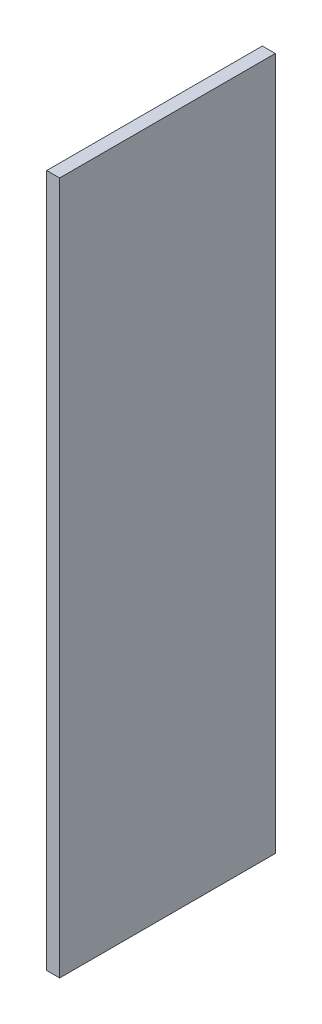
ISO-10303-21;
HEADER;
FILE_DESCRIPTION(('STEP AP214'),'2;1');
FILE_NAME('part.step','',(''),(''),'','','');
FILE_SCHEMA(('AUTOMOTIVE_DESIGN { 1 0 10303 214 1 1 1 1 }'));
ENDSEC;
DATA;
#1=APPLICATION_CONTEXT('core data for automotive mechanical design processes');
#2=APPLICATION_PROTOCOL_DEFINITION('international standard','automotive_design',2000,#1);
#3=PRODUCT_CONTEXT('',#1,'mechanical');
#4=PRODUCT('Part','Part','',(#3));
#5=PRODUCT_RELATED_PRODUCT_CATEGORY('part','',(#4));
#6=PRODUCT_DEFINITION_FORMATION('','',#4);
#7=PRODUCT_DEFINITION_CONTEXT('part definition',#1,'design');
#8=PRODUCT_DEFINITION('design','',#6,#7);
#9=PRODUCT_DEFINITION_SHAPE('','',#8);
#10=(LENGTH_UNIT() NAMED_UNIT(*) SI_UNIT(.MILLI.,.METRE.));
#11=(NAMED_UNIT(*) PLANE_ANGLE_UNIT() SI_UNIT($,.RADIAN.));
#12=(NAMED_UNIT(*) SI_UNIT($,.STERADIAN.) SOLID_ANGLE_UNIT());
#13=UNCERTAINTY_MEASURE_WITH_UNIT(LENGTH_MEASURE(1.E-05),#10,'distance_accuracy_value','');
#14=(GEOMETRIC_REPRESENTATION_CONTEXT(3) GLOBAL_UNCERTAINTY_ASSIGNED_CONTEXT((#13)) GLOBAL_UNIT_ASSIGNED_CONTEXT((#10,
#11,#12)) REPRESENTATION_CONTEXT('',''));
#15=CARTESIAN_POINT('',(0.,0.,0.));
#16=DIRECTION('',(0.,0.,1.));
#17=DIRECTION('',(1.,0.,0.));
#18=AXIS2_PLACEMENT_3D('',#15,#16,#17);
#19=CARTESIAN_POINT('',(18.,-906.219556499024,267.607933188847));
#20=DIRECTION('',(0.,0.,-1.));
#21=DIRECTION('',(-1.,0.,0.));
#22=AXIS2_PLACEMENT_3D('',#19,#20,#21);
#23=PLANE('',#22);
#24=DIRECTION('',(0.,-1.,0.));
#25=VECTOR('',#24,1.);
#26=CARTESIAN_POINT('',(0.,-906.219556499024,267.607933188847));
#27=LINE('',#26,#25);
#28=CARTESIAN_POINT('',(0.,57.7804435009756,267.607933188847));
#29=VERTEX_POINT('',#28);
#30=CARTESIAN_POINT('',(0.,-906.219556499024,267.607933188847));
#31=VERTEX_POINT('',#30);
#32=EDGE_CURVE('E96',#29,#31,#27,.T.);
#33=ORIENTED_EDGE('',*,*,#32,.T.);
#34=DIRECTION('',(-1.,0.,0.));
#35=VECTOR('',#34,1.);
#36=CARTESIAN_POINT('',(18.,-906.219556499024,267.607933188847));
#37=LINE('',#36,#35);
#38=CARTESIAN_POINT('',(18.,-906.219556499024,267.607933188847));
#39=VERTEX_POINT('',#38);
#40=EDGE_CURVE('E11',#39,#31,#37,.T.);
#41=ORIENTED_EDGE('',*,*,#40,.F.);
#42=DIRECTION('',(0.,-1.,0.));
#43=VECTOR('',#42,1.);
#44=CARTESIAN_POINT('',(18.,-906.219556499024,267.607933188847));
#45=LINE('',#44,#43);
#46=CARTESIAN_POINT('',(18.,57.7804435009756,267.607933188847));
#47=VERTEX_POINT('',#46);
#48=EDGE_CURVE('E84',#47,#39,#45,.T.);
#49=ORIENTED_EDGE('',*,*,#48,.F.);
#50=DIRECTION('',(-1.,0.,0.));
#51=VECTOR('',#50,1.);
#52=CARTESIAN_POINT('',(18.,57.7804435009756,267.607933188847));
#53=LINE('',#52,#51);
#54=EDGE_CURVE('E92',#47,#29,#53,.T.);
#55=ORIENTED_EDGE('',*,*,#54,.T.);
#56=EDGE_LOOP('',(#33,#41,#49,#55));
#57=FACE_BOUND('',#56,.T.);
#58=ADVANCED_FACE('F33',(#57),#23,.F.);
#59=CARTESIAN_POINT('',(18.,-906.219556499024,-32.392066811153));
#60=DIRECTION('',(0.,1.,0.));
#61=DIRECTION('',(0.,0.,1.));
#62=AXIS2_PLACEMENT_3D('',#59,#60,#61);
#63=PLANE('',#62);
#64=DIRECTION('',(0.,0.,-1.));
#65=VECTOR('',#64,1.);
#66=CARTESIAN_POINT('',(0.,-906.219556499024,-32.392066811153));
#67=LINE('',#66,#65);
#68=CARTESIAN_POINT('',(0.,-906.219556499024,-32.392066811153));
#69=VERTEX_POINT('',#68);
#70=EDGE_CURVE('E88',#31,#69,#67,.T.);
#71=ORIENTED_EDGE('',*,*,#70,.T.);
#72=DIRECTION('',(-1.,0.,0.));
#73=VECTOR('',#72,1.);
#74=CARTESIAN_POINT('',(18.,-906.219556499024,-32.392066811153));
#75=LINE('',#74,#73);
#76=CARTESIAN_POINT('',(18.,-906.219556499024,-32.392066811153));
#77=VERTEX_POINT('',#76);
#78=EDGE_CURVE('E41',#77,#69,#75,.T.);
#79=ORIENTED_EDGE('',*,*,#78,.F.);
#80=DIRECTION('',(0.,0.,-1.));
#81=VECTOR('',#80,1.);
#82=CARTESIAN_POINT('',(18.,-906.219556499024,-32.392066811153));
#83=LINE('',#82,#81);
#84=EDGE_CURVE('E79',#39,#77,#83,.T.);
#85=ORIENTED_EDGE('',*,*,#84,.F.);
#86=ORIENTED_EDGE('',*,*,#40,.T.);
#87=EDGE_LOOP('',(#71,#79,#85,#86));
#88=FACE_BOUND('',#87,.T.);
#89=ADVANCED_FACE('F87',(#88),#63,.F.);
#90=CARTESIAN_POINT('',(18.,-906.219556499024,-32.392066811153));
#91=DIRECTION('',(0.,0.,1.));
#92=DIRECTION('',(1.,0.,0.));
#93=AXIS2_PLACEMENT_3D('',#90,#91,#92);
#94=PLANE('',#93);
#95=DIRECTION('',(0.,1.,0.));
#96=VECTOR('',#95,1.);
#97=CARTESIAN_POINT('',(0.,-906.219556499024,-32.392066811153));
#98=LINE('',#97,#96);
#99=CARTESIAN_POINT('',(0.,57.7804435009756,-32.392066811153));
#100=VERTEX_POINT('',#99);
#101=EDGE_CURVE('E66',#69,#100,#98,.T.);
#102=ORIENTED_EDGE('',*,*,#101,.T.);
#103=DIRECTION('',(-1.,0.,0.));
#104=VECTOR('',#103,1.);
#105=CARTESIAN_POINT('',(18.,57.7804435009756,-32.392066811153));
#106=LINE('',#105,#104);
#107=CARTESIAN_POINT('',(18.,57.7804435009756,-32.392066811153));
#108=VERTEX_POINT('',#107);
#109=EDGE_CURVE('E89',#108,#100,#106,.T.);
#110=ORIENTED_EDGE('',*,*,#109,.F.);
#111=DIRECTION('',(0.,1.,0.));
#112=VECTOR('',#111,1.);
#113=CARTESIAN_POINT('',(18.,-906.219556499024,-32.392066811153));
#114=LINE('',#113,#112);
#115=EDGE_CURVE('E82',#77,#108,#114,.T.);
#116=ORIENTED_EDGE('',*,*,#115,.F.);
#117=ORIENTED_EDGE('',*,*,#78,.T.);
#118=EDGE_LOOP('',(#102,#110,#116,#117));
#119=FACE_BOUND('',#118,.T.);
#120=ADVANCED_FACE('F90',(#119),#94,.F.);
#121=CARTESIAN_POINT('',(18.,57.7804435009756,-32.392066811153));
#122=DIRECTION('',(0.,-1.,0.));
#123=DIRECTION('',(0.,0.,-1.));
#124=AXIS2_PLACEMENT_3D('',#121,#122,#123);
#125=PLANE('',#124);
#126=DIRECTION('',(0.,0.,1.));
#127=VECTOR('',#126,1.);
#128=CARTESIAN_POINT('',(0.,57.7804435009756,-32.392066811153));
#129=LINE('',#128,#127);
#130=EDGE_CURVE('E72',#100,#29,#129,.T.);
#131=ORIENTED_EDGE('',*,*,#130,.T.);
#132=ORIENTED_EDGE('',*,*,#54,.F.);
#133=DIRECTION('',(0.,0.,1.));
#134=VECTOR('',#133,1.);
#135=CARTESIAN_POINT('',(18.,57.7804435009756,-32.392066811153));
#136=LINE('',#135,#134);
#137=EDGE_CURVE('E49',#108,#47,#136,.T.);
#138=ORIENTED_EDGE('',*,*,#137,.F.);
#139=ORIENTED_EDGE('',*,*,#109,.T.);
#140=EDGE_LOOP('',(#131,#132,#138,#139));
#141=FACE_BOUND('',#140,.T.);
#142=ADVANCED_FACE('F103',(#141),#125,.F.);
#143=CARTESIAN_POINT('',(18.,0.,0.));
#144=DIRECTION('',(1.,0.,0.));
#145=DIRECTION('',(0.,0.,-1.));
#146=AXIS2_PLACEMENT_3D('',#143,#144,#145);
#147=PLANE('',#146);
#148=ORIENTED_EDGE('',*,*,#48,.T.);
#149=ORIENTED_EDGE('',*,*,#84,.T.);
#150=ORIENTED_EDGE('',*,*,#115,.T.);
#151=ORIENTED_EDGE('',*,*,#137,.T.);
#152=EDGE_LOOP('',(#148,#149,#150,#151));
#153=FACE_BOUND('',#152,.T.);
#154=ADVANCED_FACE('F80',(#153),#147,.T.);
#155=CARTESIAN_POINT('',(0.,0.,0.));
#156=DIRECTION('',(1.,0.,0.));
#157=DIRECTION('',(0.,0.,-1.));
#158=AXIS2_PLACEMENT_3D('',#155,#156,#157);
#159=PLANE('',#158);
#160=ORIENTED_EDGE('',*,*,#32,.F.);
#161=ORIENTED_EDGE('',*,*,#130,.F.);
#162=ORIENTED_EDGE('',*,*,#101,.F.);
#163=ORIENTED_EDGE('',*,*,#70,.F.);
#164=EDGE_LOOP('',(#160,#161,#162,#163));
#165=FACE_BOUND('',#164,.T.);
#166=ADVANCED_FACE('F106',(#165),#159,.F.);
#167=CLOSED_SHELL('',(#58,#89,#120,#142,#154,#166));
#168=MANIFOLD_SOLID_BREP('B2',#167);
#169=ADVANCED_BREP_SHAPE_REPRESENTATION('',(#18,#168),#14);
#170=SHAPE_DEFINITION_REPRESENTATION(#9,#169);
ENDSEC;
END-ISO-10303-21;
